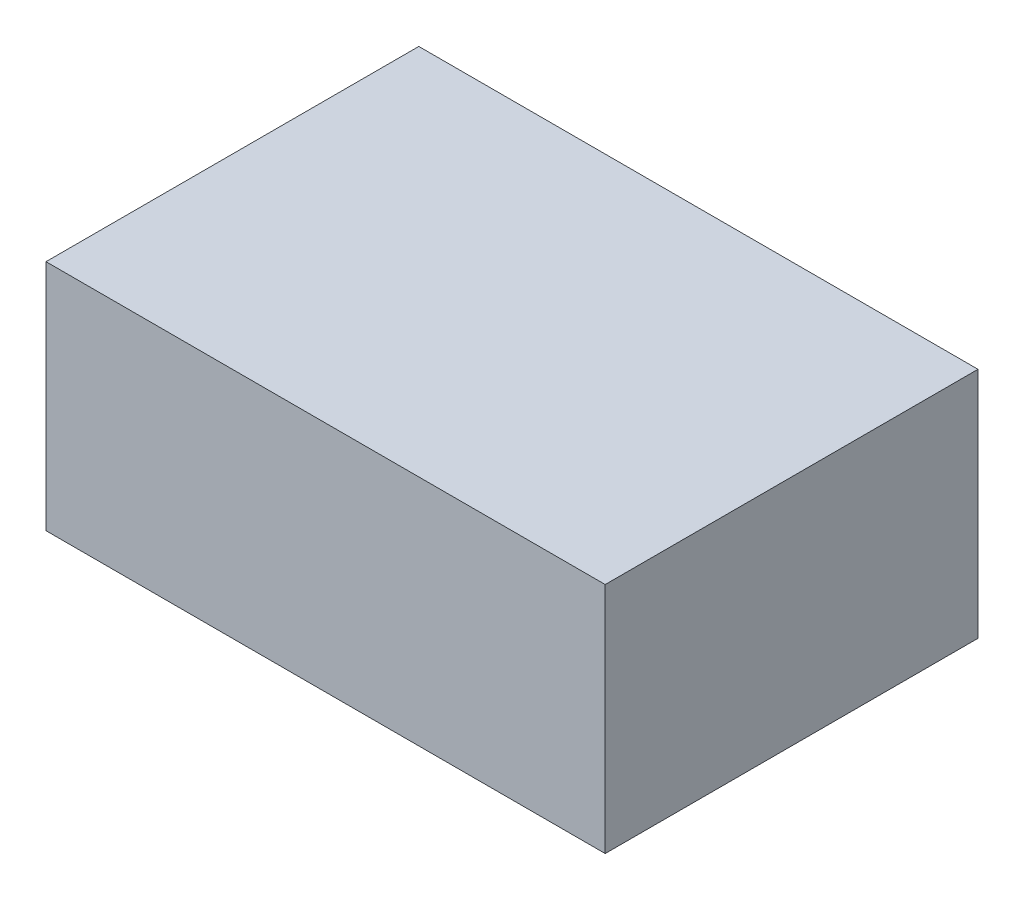
ISO-10303-21;
HEADER;
FILE_DESCRIPTION(('STEP AP214'),'2;1');
FILE_NAME('part.step','',(''),(''),'','','');
FILE_SCHEMA(('AUTOMOTIVE_DESIGN { 1 0 10303 214 1 1 1 1 }'));
ENDSEC;
DATA;
#1=APPLICATION_CONTEXT('core data for automotive mechanical design processes');
#2=APPLICATION_PROTOCOL_DEFINITION('international standard','automotive_design',2000,#1);
#3=PRODUCT_CONTEXT('',#1,'mechanical');
#4=PRODUCT('Part','Part','',(#3));
#5=PRODUCT_RELATED_PRODUCT_CATEGORY('part','',(#4));
#6=PRODUCT_DEFINITION_FORMATION('','',#4);
#7=PRODUCT_DEFINITION_CONTEXT('part definition',#1,'design');
#8=PRODUCT_DEFINITION('design','',#6,#7);
#9=PRODUCT_DEFINITION_SHAPE('','',#8);
#10=(LENGTH_UNIT() NAMED_UNIT(*) SI_UNIT(.MILLI.,.METRE.));
#11=(NAMED_UNIT(*) PLANE_ANGLE_UNIT() SI_UNIT($,.RADIAN.));
#12=(NAMED_UNIT(*) SI_UNIT($,.STERADIAN.) SOLID_ANGLE_UNIT());
#13=UNCERTAINTY_MEASURE_WITH_UNIT(LENGTH_MEASURE(1.E-05),#10,'distance_accuracy_value','');
#14=(GEOMETRIC_REPRESENTATION_CONTEXT(3) GLOBAL_UNCERTAINTY_ASSIGNED_CONTEXT((#13)) GLOBAL_UNIT_ASSIGNED_CONTEXT((#10,
#11,#12)) REPRESENTATION_CONTEXT('',''));
#15=CARTESIAN_POINT('',(0.,0.,0.));
#16=DIRECTION('',(0.,0.,1.));
#17=DIRECTION('',(1.,0.,0.));
#18=AXIS2_PLACEMENT_3D('',#15,#16,#17);
#19=CARTESIAN_POINT('',(-152.4,63.5,-101.6));
#20=DIRECTION('',(1.,0.,0.));
#21=DIRECTION('',(0.,0.,-1.));
#22=AXIS2_PLACEMENT_3D('',#19,#20,#21);
#23=PLANE('',#22);
#24=DIRECTION('',(0.,0.,1.));
#25=VECTOR('',#24,1.);
#26=CARTESIAN_POINT('',(-152.4,-63.5,-101.6));
#27=LINE('',#26,#25);
#28=CARTESIAN_POINT('',(-152.4,-63.5,-101.6));
#29=VERTEX_POINT('',#28);
#30=CARTESIAN_POINT('',(-152.4,-63.5,101.6));
#31=VERTEX_POINT('',#30);
#32=EDGE_CURVE('E98',#29,#31,#27,.T.);
#33=ORIENTED_EDGE('',*,*,#32,.T.);
#34=DIRECTION('',(0.,-1.,0.));
#35=VECTOR('',#34,1.);
#36=CARTESIAN_POINT('',(-152.4,63.5,101.6));
#37=LINE('',#36,#35);
#38=CARTESIAN_POINT('',(-152.4,63.5,101.6));
#39=VERTEX_POINT('',#38);
#40=EDGE_CURVE('E11',#39,#31,#37,.T.);
#41=ORIENTED_EDGE('',*,*,#40,.F.);
#42=DIRECTION('',(0.,0.,1.));
#43=VECTOR('',#42,1.);
#44=CARTESIAN_POINT('',(-152.4,63.5,-101.6));
#45=LINE('',#44,#43);
#46=CARTESIAN_POINT('',(-152.4,63.5,-101.6));
#47=VERTEX_POINT('',#46);
#48=EDGE_CURVE('E86',#47,#39,#45,.T.);
#49=ORIENTED_EDGE('',*,*,#48,.F.);
#50=DIRECTION('',(0.,-1.,0.));
#51=VECTOR('',#50,1.);
#52=CARTESIAN_POINT('',(-152.4,63.5,-101.6));
#53=LINE('',#52,#51);
#54=EDGE_CURVE('E94',#47,#29,#53,.T.);
#55=ORIENTED_EDGE('',*,*,#54,.T.);
#56=EDGE_LOOP('',(#33,#41,#49,#55));
#57=FACE_BOUND('',#56,.T.);
#58=ADVANCED_FACE('F35',(#57),#23,.F.);
#59=CARTESIAN_POINT('',(-152.4,63.5,101.6));
#60=DIRECTION('',(0.,0.,-1.));
#61=DIRECTION('',(-1.,0.,0.));
#62=AXIS2_PLACEMENT_3D('',#59,#60,#61);
#63=PLANE('',#62);
#64=DIRECTION('',(1.,0.,0.));
#65=VECTOR('',#64,1.);
#66=CARTESIAN_POINT('',(-152.4,-63.5,101.6));
#67=LINE('',#66,#65);
#68=CARTESIAN_POINT('',(152.4,-63.5,101.6));
#69=VERTEX_POINT('',#68);
#70=EDGE_CURVE('E90',#31,#69,#67,.T.);
#71=ORIENTED_EDGE('',*,*,#70,.T.);
#72=DIRECTION('',(0.,-1.,0.));
#73=VECTOR('',#72,1.);
#74=CARTESIAN_POINT('',(152.4,63.5,101.6));
#75=LINE('',#74,#73);
#76=CARTESIAN_POINT('',(152.4,63.5,101.6));
#77=VERTEX_POINT('',#76);
#78=EDGE_CURVE('E43',#77,#69,#75,.T.);
#79=ORIENTED_EDGE('',*,*,#78,.F.);
#80=DIRECTION('',(1.,0.,0.));
#81=VECTOR('',#80,1.);
#82=CARTESIAN_POINT('',(-152.4,63.5,101.6));
#83=LINE('',#82,#81);
#84=EDGE_CURVE('E81',#39,#77,#83,.T.);
#85=ORIENTED_EDGE('',*,*,#84,.F.);
#86=ORIENTED_EDGE('',*,*,#40,.T.);
#87=EDGE_LOOP('',(#71,#79,#85,#86));
#88=FACE_BOUND('',#87,.T.);
#89=ADVANCED_FACE('F89',(#88),#63,.F.);
#90=CARTESIAN_POINT('',(152.4,63.5,-101.6));
#91=DIRECTION('',(-1.,0.,0.));
#92=DIRECTION('',(0.,0.,1.));
#93=AXIS2_PLACEMENT_3D('',#90,#91,#92);
#94=PLANE('',#93);
#95=DIRECTION('',(0.,0.,-1.));
#96=VECTOR('',#95,1.);
#97=CARTESIAN_POINT('',(152.4,-63.5,-101.6));
#98=LINE('',#97,#96);
#99=CARTESIAN_POINT('',(152.4,-63.5,-101.6));
#100=VERTEX_POINT('',#99);
#101=EDGE_CURVE('E68',#69,#100,#98,.T.);
#102=ORIENTED_EDGE('',*,*,#101,.T.);
#103=DIRECTION('',(0.,-1.,0.));
#104=VECTOR('',#103,1.);
#105=CARTESIAN_POINT('',(152.4,63.5,-101.6));
#106=LINE('',#105,#104);
#107=CARTESIAN_POINT('',(152.4,63.5,-101.6));
#108=VERTEX_POINT('',#107);
#109=EDGE_CURVE('E91',#108,#100,#106,.T.);
#110=ORIENTED_EDGE('',*,*,#109,.F.);
#111=DIRECTION('',(0.,0.,-1.));
#112=VECTOR('',#111,1.);
#113=CARTESIAN_POINT('',(152.4,63.5,-101.6));
#114=LINE('',#113,#112);
#115=EDGE_CURVE('E84',#77,#108,#114,.T.);
#116=ORIENTED_EDGE('',*,*,#115,.F.);
#117=ORIENTED_EDGE('',*,*,#78,.T.);
#118=EDGE_LOOP('',(#102,#110,#116,#117));
#119=FACE_BOUND('',#118,.T.);
#120=ADVANCED_FACE('F92',(#119),#94,.F.);
#121=CARTESIAN_POINT('',(-152.4,63.5,-101.6));
#122=DIRECTION('',(0.,0.,1.));
#123=DIRECTION('',(1.,0.,0.));
#124=AXIS2_PLACEMENT_3D('',#121,#122,#123);
#125=PLANE('',#124);
#126=DIRECTION('',(-1.,0.,0.));
#127=VECTOR('',#126,1.);
#128=CARTESIAN_POINT('',(-152.4,-63.5,-101.6));
#129=LINE('',#128,#127);
#130=EDGE_CURVE('E74',#100,#29,#129,.T.);
#131=ORIENTED_EDGE('',*,*,#130,.T.);
#132=ORIENTED_EDGE('',*,*,#54,.F.);
#133=DIRECTION('',(-1.,0.,0.));
#134=VECTOR('',#133,1.);
#135=CARTESIAN_POINT('',(-152.4,63.5,-101.6));
#136=LINE('',#135,#134);
#137=EDGE_CURVE('E51',#108,#47,#136,.T.);
#138=ORIENTED_EDGE('',*,*,#137,.F.);
#139=ORIENTED_EDGE('',*,*,#109,.T.);
#140=EDGE_LOOP('',(#131,#132,#138,#139));
#141=FACE_BOUND('',#140,.T.);
#142=ADVANCED_FACE('F105',(#141),#125,.F.);
#143=CARTESIAN_POINT('',(0.,63.5,0.));
#144=DIRECTION('',(0.,1.,0.));
#145=DIRECTION('',(0.,0.,1.));
#146=AXIS2_PLACEMENT_3D('',#143,#144,#145);
#147=PLANE('',#146);
#148=ORIENTED_EDGE('',*,*,#48,.T.);
#149=ORIENTED_EDGE('',*,*,#84,.T.);
#150=ORIENTED_EDGE('',*,*,#115,.T.);
#151=ORIENTED_EDGE('',*,*,#137,.T.);
#152=EDGE_LOOP('',(#148,#149,#150,#151));
#153=FACE_BOUND('',#152,.T.);
#154=ADVANCED_FACE('F82',(#153),#147,.T.);
#155=CARTESIAN_POINT('',(0.,-63.5,0.));
#156=DIRECTION('',(0.,1.,0.));
#157=DIRECTION('',(0.,0.,1.));
#158=AXIS2_PLACEMENT_3D('',#155,#156,#157);
#159=PLANE('',#158);
#160=ORIENTED_EDGE('',*,*,#32,.F.);
#161=ORIENTED_EDGE('',*,*,#130,.F.);
#162=ORIENTED_EDGE('',*,*,#101,.F.);
#163=ORIENTED_EDGE('',*,*,#70,.F.);
#164=EDGE_LOOP('',(#160,#161,#162,#163));
#165=FACE_BOUND('',#164,.T.);
#166=ADVANCED_FACE('F108',(#165),#159,.F.);
#167=CLOSED_SHELL('',(#58,#89,#120,#142,#154,#166));
#168=MANIFOLD_SOLID_BREP('B2',#167);
#169=ADVANCED_BREP_SHAPE_REPRESENTATION('',(#18,#168),#14);
#170=SHAPE_DEFINITION_REPRESENTATION(#9,#169);
ENDSEC;
END-ISO-10303-21;
